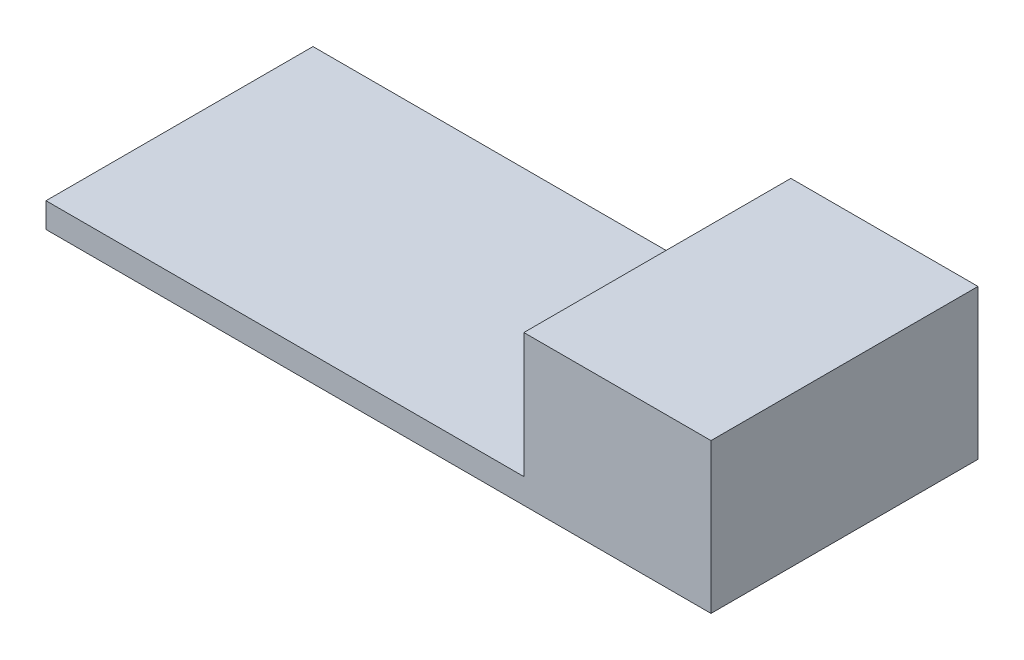
ISO-10303-21;
HEADER;
FILE_DESCRIPTION(('STEP AP214'),'2;1');
FILE_NAME('part.step','',(''),(''),'','','');
FILE_SCHEMA(('AUTOMOTIVE_DESIGN { 1 0 10303 214 1 1 1 1 }'));
ENDSEC;
DATA;
#1=APPLICATION_CONTEXT('core data for automotive mechanical design processes');
#2=APPLICATION_PROTOCOL_DEFINITION('international standard','automotive_design',2000,#1);
#3=PRODUCT_CONTEXT('',#1,'mechanical');
#4=PRODUCT('Part','Part','',(#3));
#5=PRODUCT_RELATED_PRODUCT_CATEGORY('part','',(#4));
#6=PRODUCT_DEFINITION_FORMATION('','',#4);
#7=PRODUCT_DEFINITION_CONTEXT('part definition',#1,'design');
#8=PRODUCT_DEFINITION('design','',#6,#7);
#9=PRODUCT_DEFINITION_SHAPE('','',#8);
#10=(LENGTH_UNIT() NAMED_UNIT(*) SI_UNIT(.MILLI.,.METRE.));
#11=(NAMED_UNIT(*) PLANE_ANGLE_UNIT() SI_UNIT($,.RADIAN.));
#12=(NAMED_UNIT(*) SI_UNIT($,.STERADIAN.) SOLID_ANGLE_UNIT());
#13=UNCERTAINTY_MEASURE_WITH_UNIT(LENGTH_MEASURE(1.E-05),#10,'distance_accuracy_value','');
#14=(GEOMETRIC_REPRESENTATION_CONTEXT(3) GLOBAL_UNCERTAINTY_ASSIGNED_CONTEXT((#13)) GLOBAL_UNIT_ASSIGNED_CONTEXT((#10,
#11,#12)) REPRESENTATION_CONTEXT('',''));
#15=CARTESIAN_POINT('',(0.,0.,0.));
#16=DIRECTION('',(0.,0.,1.));
#17=DIRECTION('',(1.,0.,0.));
#18=AXIS2_PLACEMENT_3D('',#15,#16,#17);
#19=CARTESIAN_POINT('',(0.,2.,0.));
#20=DIRECTION('',(0.,-1.,0.));
#21=DIRECTION('',(0.,0.,-1.));
#22=AXIS2_PLACEMENT_3D('',#19,#20,#21);
#23=PLANE('',#22);
#24=DIRECTION('',(0.,0.,1.));
#25=VECTOR('',#24,1.);
#26=CARTESIAN_POINT('',(11.65,2.,10.7));
#27=LINE('',#26,#25);
#28=CARTESIAN_POINT('',(11.65,2.,-10.7));
#29=VERTEX_POINT('',#28);
#30=CARTESIAN_POINT('',(11.65,2.,10.7));
#31=VERTEX_POINT('',#30);
#32=EDGE_CURVE('E57',#29,#31,#27,.T.);
#33=ORIENTED_EDGE('',*,*,#32,.F.);
#34=DIRECTION('',(-1.,0.,0.));
#35=VECTOR('',#34,1.);
#36=CARTESIAN_POINT('',(-26.65,2.,-10.7));
#37=LINE('',#36,#35);
#38=CARTESIAN_POINT('',(-26.65,2.,-10.7));
#39=VERTEX_POINT('',#38);
#40=EDGE_CURVE('E95',#29,#39,#37,.T.);
#41=ORIENTED_EDGE('',*,*,#40,.T.);
#42=DIRECTION('',(0.,0.,1.));
#43=VECTOR('',#42,1.);
#44=CARTESIAN_POINT('',(-26.65,2.,10.7));
#45=LINE('',#44,#43);
#46=CARTESIAN_POINT('',(-26.65,2.,10.7));
#47=VERTEX_POINT('',#46);
#48=EDGE_CURVE('E63',#39,#47,#45,.T.);
#49=ORIENTED_EDGE('',*,*,#48,.T.);
#50=DIRECTION('',(1.,0.,0.));
#51=VECTOR('',#50,1.);
#52=CARTESIAN_POINT('',(-26.65,2.,10.7));
#53=LINE('',#52,#51);
#54=EDGE_CURVE('E106',#47,#31,#53,.T.);
#55=ORIENTED_EDGE('',*,*,#54,.T.);
#56=EDGE_LOOP('',(#33,#41,#49,#55));
#57=FACE_BOUND('',#56,.T.);
#58=ADVANCED_FACE('F41',(#57),#23,.F.);
#59=CARTESIAN_POINT('',(26.65,2.,10.7));
#60=DIRECTION('',(-1.,0.,0.));
#61=DIRECTION('',(0.,0.,1.));
#62=AXIS2_PLACEMENT_3D('',#59,#60,#61);
#63=PLANE('',#62);
#64=DIRECTION('',(0.,0.,-1.));
#65=VECTOR('',#64,1.);
#66=CARTESIAN_POINT('',(26.65,0.,10.7));
#67=LINE('',#66,#65);
#68=CARTESIAN_POINT('',(26.65,0.,10.7));
#69=VERTEX_POINT('',#68);
#70=CARTESIAN_POINT('',(26.65,0.,-10.7));
#71=VERTEX_POINT('',#70);
#72=EDGE_CURVE('E102',#69,#71,#67,.T.);
#73=ORIENTED_EDGE('',*,*,#72,.T.);
#74=DIRECTION('',(0.,-1.,0.));
#75=VECTOR('',#74,1.);
#76=CARTESIAN_POINT('',(26.65,2.,-10.7));
#77=LINE('',#76,#75);
#78=CARTESIAN_POINT('',(26.65,12.,-10.7));
#79=VERTEX_POINT('',#78);
#80=EDGE_CURVE('E11',#79,#71,#77,.T.);
#81=ORIENTED_EDGE('',*,*,#80,.F.);
#82=DIRECTION('',(0.,0.,-1.));
#83=VECTOR('',#82,1.);
#84=CARTESIAN_POINT('',(26.65,12.,10.7));
#85=LINE('',#84,#83);
#86=CARTESIAN_POINT('',(26.65,12.,10.7));
#87=VERTEX_POINT('',#86);
#88=EDGE_CURVE('E104',#87,#79,#85,.T.);
#89=ORIENTED_EDGE('',*,*,#88,.F.);
#90=DIRECTION('',(0.,-1.,0.));
#91=VECTOR('',#90,1.);
#92=CARTESIAN_POINT('',(26.65,2.,10.7));
#93=LINE('',#92,#91);
#94=EDGE_CURVE('E87',#87,#69,#93,.T.);
#95=ORIENTED_EDGE('',*,*,#94,.T.);
#96=EDGE_LOOP('',(#73,#81,#89,#95));
#97=FACE_BOUND('',#96,.T.);
#98=ADVANCED_FACE('F43',(#97),#63,.F.);
#99=CARTESIAN_POINT('',(-26.65,2.,-10.7));
#100=DIRECTION('',(0.,0.,1.));
#101=DIRECTION('',(1.,0.,0.));
#102=AXIS2_PLACEMENT_3D('',#99,#100,#101);
#103=PLANE('',#102);
#104=DIRECTION('',(-1.,0.,0.));
#105=VECTOR('',#104,1.);
#106=CARTESIAN_POINT('',(-26.65,0.,-10.7));
#107=LINE('',#106,#105);
#108=CARTESIAN_POINT('',(-26.65,0.,-10.7));
#109=VERTEX_POINT('',#108);
#110=EDGE_CURVE('E109',#71,#109,#107,.T.);
#111=ORIENTED_EDGE('',*,*,#110,.T.);
#112=DIRECTION('',(0.,-1.,0.));
#113=VECTOR('',#112,1.);
#114=CARTESIAN_POINT('',(-26.65,2.,-10.7));
#115=LINE('',#114,#113);
#116=EDGE_CURVE('E50',#39,#109,#115,.T.);
#117=ORIENTED_EDGE('',*,*,#116,.F.);
#118=ORIENTED_EDGE('',*,*,#40,.F.);
#119=DIRECTION('',(0.,-1.,0.));
#120=VECTOR('',#119,1.);
#121=CARTESIAN_POINT('',(11.65,12.,-10.7));
#122=LINE('',#121,#120);
#123=CARTESIAN_POINT('',(11.65,12.,-10.7));
#124=VERTEX_POINT('',#123);
#125=EDGE_CURVE('E111',#124,#29,#122,.T.);
#126=ORIENTED_EDGE('',*,*,#125,.F.);
#127=DIRECTION('',(-1.,0.,0.));
#128=VECTOR('',#127,1.);
#129=CARTESIAN_POINT('',(26.65,12.,-10.7));
#130=LINE('',#129,#128);
#131=EDGE_CURVE('E136',#79,#124,#130,.T.);
#132=ORIENTED_EDGE('',*,*,#131,.F.);
#133=ORIENTED_EDGE('',*,*,#80,.T.);
#134=EDGE_LOOP('',(#111,#117,#118,#126,#132,#133));
#135=FACE_BOUND('',#134,.T.);
#136=ADVANCED_FACE('F131',(#135),#103,.F.);
#137=CARTESIAN_POINT('',(-26.65,2.,10.7));
#138=DIRECTION('',(1.,0.,0.));
#139=DIRECTION('',(0.,0.,-1.));
#140=AXIS2_PLACEMENT_3D('',#137,#138,#139);
#141=PLANE('',#140);
#142=DIRECTION('',(0.,0.,1.));
#143=VECTOR('',#142,1.);
#144=CARTESIAN_POINT('',(-26.65,0.,10.7));
#145=LINE('',#144,#143);
#146=CARTESIAN_POINT('',(-26.65,0.,10.7));
#147=VERTEX_POINT('',#146);
#148=EDGE_CURVE('E96',#109,#147,#145,.T.);
#149=ORIENTED_EDGE('',*,*,#148,.T.);
#150=DIRECTION('',(0.,-1.,0.));
#151=VECTOR('',#150,1.);
#152=CARTESIAN_POINT('',(-26.65,2.,10.7));
#153=LINE('',#152,#151);
#154=EDGE_CURVE('E90',#47,#147,#153,.T.);
#155=ORIENTED_EDGE('',*,*,#154,.F.);
#156=ORIENTED_EDGE('',*,*,#48,.F.);
#157=ORIENTED_EDGE('',*,*,#116,.T.);
#158=EDGE_LOOP('',(#149,#155,#156,#157));
#159=FACE_BOUND('',#158,.T.);
#160=ADVANCED_FACE('F129',(#159),#141,.F.);
#161=CARTESIAN_POINT('',(-26.65,2.,10.7));
#162=DIRECTION('',(0.,0.,-1.));
#163=DIRECTION('',(-1.,0.,0.));
#164=AXIS2_PLACEMENT_3D('',#161,#162,#163);
#165=PLANE('',#164);
#166=DIRECTION('',(1.,0.,0.));
#167=VECTOR('',#166,1.);
#168=CARTESIAN_POINT('',(-26.65,0.,10.7));
#169=LINE('',#168,#167);
#170=EDGE_CURVE('E83',#147,#69,#169,.T.);
#171=ORIENTED_EDGE('',*,*,#170,.T.);
#172=ORIENTED_EDGE('',*,*,#94,.F.);
#173=DIRECTION('',(1.,0.,0.));
#174=VECTOR('',#173,1.);
#175=CARTESIAN_POINT('',(26.65,12.,10.7));
#176=LINE('',#175,#174);
#177=CARTESIAN_POINT('',(11.65,12.,10.7));
#178=VERTEX_POINT('',#177);
#179=EDGE_CURVE('E150',#178,#87,#176,.T.);
#180=ORIENTED_EDGE('',*,*,#179,.F.);
#181=DIRECTION('',(0.,-1.,0.));
#182=VECTOR('',#181,1.);
#183=CARTESIAN_POINT('',(11.65,12.,10.7));
#184=LINE('',#183,#182);
#185=EDGE_CURVE('E117',#178,#31,#184,.T.);
#186=ORIENTED_EDGE('',*,*,#185,.T.);
#187=ORIENTED_EDGE('',*,*,#54,.F.);
#188=ORIENTED_EDGE('',*,*,#154,.T.);
#189=EDGE_LOOP('',(#171,#172,#180,#186,#187,#188));
#190=FACE_BOUND('',#189,.T.);
#191=ADVANCED_FACE('F85',(#190),#165,.F.);
#192=CARTESIAN_POINT('',(0.,0.,0.));
#193=DIRECTION('',(0.,-1.,0.));
#194=DIRECTION('',(0.,0.,-1.));
#195=AXIS2_PLACEMENT_3D('',#192,#193,#194);
#196=PLANE('',#195);
#197=ORIENTED_EDGE('',*,*,#72,.F.);
#198=ORIENTED_EDGE('',*,*,#170,.F.);
#199=ORIENTED_EDGE('',*,*,#148,.F.);
#200=ORIENTED_EDGE('',*,*,#110,.F.);
#201=EDGE_LOOP('',(#197,#198,#199,#200));
#202=FACE_BOUND('',#201,.T.);
#203=ADVANCED_FACE('F108',(#202),#196,.T.);
#204=CARTESIAN_POINT('',(11.65,12.,10.7));
#205=DIRECTION('',(1.,0.,0.));
#206=DIRECTION('',(0.,0.,-1.));
#207=AXIS2_PLACEMENT_3D('',#204,#205,#206);
#208=PLANE('',#207);
#209=ORIENTED_EDGE('',*,*,#32,.T.);
#210=ORIENTED_EDGE('',*,*,#185,.F.);
#211=DIRECTION('',(0.,0.,1.));
#212=VECTOR('',#211,1.);
#213=CARTESIAN_POINT('',(11.65,12.,10.7));
#214=LINE('',#213,#212);
#215=EDGE_CURVE('E147',#124,#178,#214,.T.);
#216=ORIENTED_EDGE('',*,*,#215,.F.);
#217=ORIENTED_EDGE('',*,*,#125,.T.);
#218=EDGE_LOOP('',(#209,#210,#216,#217));
#219=FACE_BOUND('',#218,.T.);
#220=ADVANCED_FACE('F155',(#219),#208,.F.);
#221=CARTESIAN_POINT('',(0.,12.,0.));
#222=DIRECTION('',(0.,1.,0.));
#223=DIRECTION('',(0.,0.,1.));
#224=AXIS2_PLACEMENT_3D('',#221,#222,#223);
#225=PLANE('',#224);
#226=ORIENTED_EDGE('',*,*,#88,.T.);
#227=ORIENTED_EDGE('',*,*,#131,.T.);
#228=ORIENTED_EDGE('',*,*,#215,.T.);
#229=ORIENTED_EDGE('',*,*,#179,.T.);
#230=EDGE_LOOP('',(#226,#227,#228,#229));
#231=FACE_BOUND('',#230,.T.);
#232=ADVANCED_FACE('F149',(#231),#225,.T.);
#233=CLOSED_SHELL('',(#58,#98,#136,#160,#191,#203,#220,#232));
#234=MANIFOLD_SOLID_BREP('B2',#233);
#235=ADVANCED_BREP_SHAPE_REPRESENTATION('',(#18,#234),#14);
#236=SHAPE_DEFINITION_REPRESENTATION(#9,#235);
ENDSEC;
END-ISO-10303-21;
